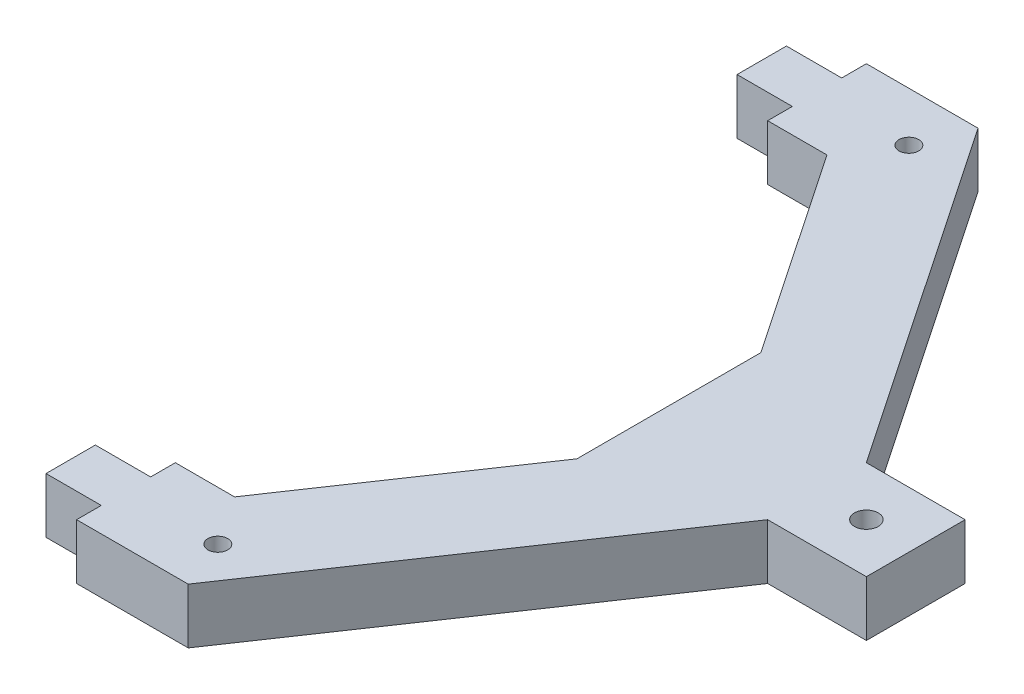
ISO-10303-21;
HEADER;
FILE_DESCRIPTION(('STEP AP214'),'2;1');
FILE_NAME('part.step','',(''),(''),'','','');
FILE_SCHEMA(('AUTOMOTIVE_DESIGN { 1 0 10303 214 1 1 1 1 }'));
ENDSEC;
DATA;
#1=APPLICATION_CONTEXT('core data for automotive mechanical design processes');
#2=APPLICATION_PROTOCOL_DEFINITION('international standard','automotive_design',2000,#1);
#3=PRODUCT_CONTEXT('',#1,'mechanical');
#4=PRODUCT('Part','Part','',(#3));
#5=PRODUCT_RELATED_PRODUCT_CATEGORY('part','',(#4));
#6=PRODUCT_DEFINITION_FORMATION('','',#4);
#7=PRODUCT_DEFINITION_CONTEXT('part definition',#1,'design');
#8=PRODUCT_DEFINITION('design','',#6,#7);
#9=PRODUCT_DEFINITION_SHAPE('','',#8);
#10=(LENGTH_UNIT() NAMED_UNIT(*) SI_UNIT(.MILLI.,.METRE.));
#11=(NAMED_UNIT(*) PLANE_ANGLE_UNIT() SI_UNIT($,.RADIAN.));
#12=(NAMED_UNIT(*) SI_UNIT($,.STERADIAN.) SOLID_ANGLE_UNIT());
#13=UNCERTAINTY_MEASURE_WITH_UNIT(LENGTH_MEASURE(1.E-05),#10,'distance_accuracy_value','');
#14=(GEOMETRIC_REPRESENTATION_CONTEXT(3) GLOBAL_UNCERTAINTY_ASSIGNED_CONTEXT((#13)) GLOBAL_UNIT_ASSIGNED_CONTEXT((#10,
#11,#12)) REPRESENTATION_CONTEXT('',''));
#15=CARTESIAN_POINT('',(0.,0.,0.));
#16=DIRECTION('',(0.,0.,1.));
#17=DIRECTION('',(1.,0.,0.));
#18=AXIS2_PLACEMENT_3D('',#15,#16,#17);
#19=CARTESIAN_POINT('',(-87.5,14.,0.));
#20=DIRECTION('',(1.,0.,0.));
#21=DIRECTION('',(0.,0.,-1.));
#22=AXIS2_PLACEMENT_3D('',#19,#20,#21);
#23=PLANE('',#22);
#24=DIRECTION('',(0.,1.,0.));
#25=VECTOR('',#24,1.);
#26=CARTESIAN_POINT('',(-87.5,-18.7683243791235,-93.75));
#27=LINE('',#26,#25);
#28=CARTESIAN_POINT('',(-87.5,0.,-93.75));
#29=VERTEX_POINT('',#28);
#30=CARTESIAN_POINT('',(-87.5,14.,-93.75));
#31=VERTEX_POINT('',#30);
#32=EDGE_CURVE('E72',#29,#31,#27,.T.);
#33=ORIENTED_EDGE('',*,*,#32,.F.);
#34=DIRECTION('',(0.,0.,1.));
#35=VECTOR('',#34,1.);
#36=CARTESIAN_POINT('',(-87.5,0.,0.));
#37=LINE('',#36,#35);
#38=CARTESIAN_POINT('',(-87.5,0.,-87.5));
#39=VERTEX_POINT('',#38);
#40=EDGE_CURVE('E353',#29,#39,#37,.T.);
#41=ORIENTED_EDGE('',*,*,#40,.T.);
#42=DIRECTION('',(0.,-1.,0.));
#43=VECTOR('',#42,1.);
#44=CARTESIAN_POINT('',(-87.5,14.,-87.5));
#45=LINE('',#44,#43);
#46=CARTESIAN_POINT('',(-87.5,14.,-87.5));
#47=VERTEX_POINT('',#46);
#48=EDGE_CURVE('E364',#47,#39,#45,.T.);
#49=ORIENTED_EDGE('',*,*,#48,.F.);
#50=DIRECTION('',(0.,0.,1.));
#51=VECTOR('',#50,1.);
#52=CARTESIAN_POINT('',(-87.5,14.,0.));
#53=LINE('',#52,#51);
#54=EDGE_CURVE('E331',#31,#47,#53,.T.);
#55=ORIENTED_EDGE('',*,*,#54,.F.);
#56=EDGE_LOOP('',(#33,#41,#49,#55));
#57=FACE_BOUND('',#56,.T.);
#58=ADVANCED_FACE('F49',(#57),#23,.F.);
#59=CARTESIAN_POINT('',(-37.5,14.,0.));
#60=DIRECTION('',(1.,0.,0.));
#61=DIRECTION('',(0.,0.,-1.));
#62=AXIS2_PLACEMENT_3D('',#59,#60,#61);
#63=PLANE('',#62);
#64=DIRECTION('',(0.,0.,1.));
#65=VECTOR('',#64,1.);
#66=CARTESIAN_POINT('',(-37.5,0.,0.));
#67=LINE('',#66,#65);
#68=CARTESIAN_POINT('',(-37.5,0.,-35.7985114321141));
#69=VERTEX_POINT('',#68);
#70=CARTESIAN_POINT('',(-37.5,0.,10.7985114321141));
#71=VERTEX_POINT('',#70);
#72=EDGE_CURVE('E315',#69,#71,#67,.T.);
#73=ORIENTED_EDGE('',*,*,#72,.T.);
#74=DIRECTION('',(0.,-1.,0.));
#75=VECTOR('',#74,1.);
#76=CARTESIAN_POINT('',(-37.5,14.,10.7985114321141));
#77=LINE('',#76,#75);
#78=CARTESIAN_POINT('',(-37.5,14.,10.7985114321141));
#79=VERTEX_POINT('',#78);
#80=EDGE_CURVE('E255',#79,#71,#77,.T.);
#81=ORIENTED_EDGE('',*,*,#80,.F.);
#82=DIRECTION('',(0.,0.,1.));
#83=VECTOR('',#82,1.);
#84=CARTESIAN_POINT('',(-37.5,14.,0.));
#85=LINE('',#84,#83);
#86=CARTESIAN_POINT('',(-37.5,14.,-35.7985114321141));
#87=VERTEX_POINT('',#86);
#88=EDGE_CURVE('E316',#87,#79,#85,.T.);
#89=ORIENTED_EDGE('',*,*,#88,.F.);
#90=DIRECTION('',(0.,-1.,0.));
#91=VECTOR('',#90,1.);
#92=CARTESIAN_POINT('',(-37.5,14.,-35.7985114321141));
#93=LINE('',#92,#91);
#94=EDGE_CURVE('E338',#87,#69,#93,.T.);
#95=ORIENTED_EDGE('',*,*,#94,.T.);
#96=EDGE_LOOP('',(#73,#81,#89,#95));
#97=FACE_BOUND('',#96,.T.);
#98=ADVANCED_FACE('F51',(#97),#63,.F.);
#99=CARTESIAN_POINT('',(12.5,14.,-12.5));
#100=DIRECTION('',(0.,-1.,0.));
#101=DIRECTION('',(0.,0.,-1.));
#102=AXIS2_PLACEMENT_3D('',#99,#100,#101);
#103=CYLINDRICAL_SURFACE('',#102,3.);
#104=CARTESIAN_POINT('',(12.5,0.,-12.5));
#105=DIRECTION('',(0.,1.,0.));
#106=DIRECTION('',(0.,0.,1.));
#107=AXIS2_PLACEMENT_3D('',#104,#105,#106);
#108=CIRCLE('',#107,3.);
#109=CARTESIAN_POINT('',(12.5,0.,-9.5));
#110=VERTEX_POINT('',#109);
#111=EDGE_CURVE('E340',#110,#110,#108,.F.);
#112=ORIENTED_EDGE('',*,*,#111,.T.);
#113=EDGE_LOOP('',(#112));
#114=FACE_BOUND('',#113,.T.);
#115=CARTESIAN_POINT('',(12.5,14.,-12.5));
#116=DIRECTION('',(0.,1.,0.));
#117=DIRECTION('',(0.,0.,1.));
#118=AXIS2_PLACEMENT_3D('',#115,#116,#117);
#119=CIRCLE('',#118,3.);
#120=CARTESIAN_POINT('',(12.5,14.,-9.5));
#121=VERTEX_POINT('',#120);
#122=EDGE_CURVE('E318',#121,#121,#119,.F.);
#123=ORIENTED_EDGE('',*,*,#122,.F.);
#124=EDGE_LOOP('',(#123));
#125=FACE_BOUND('',#124,.T.);
#126=ADVANCED_FACE('F431',(#114,#125),#103,.F.);
#127=CARTESIAN_POINT('',(25.,14.,0.));
#128=DIRECTION('',(-1.,0.,0.));
#129=DIRECTION('',(0.,0.,1.));
#130=AXIS2_PLACEMENT_3D('',#127,#128,#129);
#131=PLANE('',#130);
#132=DIRECTION('',(0.,0.,-1.));
#133=VECTOR('',#132,1.);
#134=CARTESIAN_POINT('',(25.,0.,0.));
#135=LINE('',#134,#133);
#136=CARTESIAN_POINT('',(25.,0.,0.));
#137=VERTEX_POINT('',#136);
#138=CARTESIAN_POINT('',(25.,0.,-25.));
#139=VERTEX_POINT('',#138);
#140=EDGE_CURVE('E343',#137,#139,#135,.T.);
#141=ORIENTED_EDGE('',*,*,#140,.T.);
#142=DIRECTION('',(0.,-1.,0.));
#143=VECTOR('',#142,1.);
#144=CARTESIAN_POINT('',(25.,14.,-25.));
#145=LINE('',#144,#143);
#146=CARTESIAN_POINT('',(25.,14.,-25.));
#147=VERTEX_POINT('',#146);
#148=EDGE_CURVE('E11',#147,#139,#145,.T.);
#149=ORIENTED_EDGE('',*,*,#148,.F.);
#150=DIRECTION('',(0.,0.,-1.));
#151=VECTOR('',#150,1.);
#152=CARTESIAN_POINT('',(25.,14.,0.));
#153=LINE('',#152,#151);
#154=CARTESIAN_POINT('',(25.,14.,0.));
#155=VERTEX_POINT('',#154);
#156=EDGE_CURVE('E322',#155,#147,#153,.T.);
#157=ORIENTED_EDGE('',*,*,#156,.F.);
#158=DIRECTION('',(0.,-1.,0.));
#159=VECTOR('',#158,1.);
#160=CARTESIAN_POINT('',(25.,14.,0.));
#161=LINE('',#160,#159);
#162=EDGE_CURVE('E290',#155,#137,#161,.T.);
#163=ORIENTED_EDGE('',*,*,#162,.T.);
#164=EDGE_LOOP('',(#141,#149,#157,#163));
#165=FACE_BOUND('',#164,.T.);
#166=ADVANCED_FACE('F388',(#165),#131,.F.);
#167=CARTESIAN_POINT('',(0.,14.,-25.));
#168=DIRECTION('',(0.,0.,-1.));
#169=DIRECTION('',(-1.,0.,0.));
#170=AXIS2_PLACEMENT_3D('',#167,#168,#169);
#171=PLANE('',#170);
#172=DIRECTION('',(1.,0.,0.));
#173=VECTOR('',#172,1.);
#174=CARTESIAN_POINT('',(0.,0.,-25.));
#175=LINE('',#174,#173);
#176=CARTESIAN_POINT('',(0.,0.,-25.));
#177=VERTEX_POINT('',#176);
#178=EDGE_CURVE('E346',#177,#139,#175,.T.);
#179=ORIENTED_EDGE('',*,*,#178,.F.);
#180=DIRECTION('',(0.,-1.,0.));
#181=VECTOR('',#180,1.);
#182=CARTESIAN_POINT('',(0.,14.,-25.));
#183=LINE('',#182,#181);
#184=CARTESIAN_POINT('',(0.,14.,-25.));
#185=VERTEX_POINT('',#184);
#186=EDGE_CURVE('E57',#185,#177,#183,.T.);
#187=ORIENTED_EDGE('',*,*,#186,.F.);
#188=DIRECTION('',(1.,0.,0.));
#189=VECTOR('',#188,1.);
#190=CARTESIAN_POINT('',(0.,14.,-25.));
#191=LINE('',#190,#189);
#192=EDGE_CURVE('E324',#185,#147,#191,.T.);
#193=ORIENTED_EDGE('',*,*,#192,.T.);
#194=ORIENTED_EDGE('',*,*,#148,.T.);
#195=EDGE_LOOP('',(#179,#187,#193,#194));
#196=FACE_BOUND('',#195,.T.);
#197=ADVANCED_FACE('F385',(#196),#171,.T.);
#198=CARTESIAN_POINT('',(11.6055137971177,14.,-7.85650460268225));
#199=DIRECTION('',(-0.828094086377091,0.,0.560589140197427));
#200=DIRECTION('',(0.560589140197427,0.,0.828094086377091));
#201=AXIS2_PLACEMENT_3D('',#198,#199,#200);
#202=PLANE('',#201);
#203=DIRECTION('',(-0.560589140197427,0.,-0.828094086377091));
#204=VECTOR('',#203,1.);
#205=CARTESIAN_POINT('',(11.6055137971177,0.,-7.85650460268225));
#206=LINE('',#205,#204);
#207=CARTESIAN_POINT('',(-59.2342712914123,0.,-112.5));
#208=VERTEX_POINT('',#207);
#209=EDGE_CURVE('E349',#177,#208,#206,.T.);
#210=ORIENTED_EDGE('',*,*,#209,.T.);
#211=DIRECTION('',(0.,-1.,0.));
#212=VECTOR('',#211,1.);
#213=CARTESIAN_POINT('',(-59.2342712914123,14.,-112.5));
#214=LINE('',#213,#212);
#215=CARTESIAN_POINT('',(-59.2342712914123,14.,-112.5));
#216=VERTEX_POINT('',#215);
#217=EDGE_CURVE('E370',#216,#208,#214,.T.);
#218=ORIENTED_EDGE('',*,*,#217,.F.);
#219=DIRECTION('',(-0.560589140197427,0.,-0.828094086377091));
#220=VECTOR('',#219,1.);
#221=CARTESIAN_POINT('',(11.6055137971177,14.,-7.85650460268225));
#222=LINE('',#221,#220);
#223=EDGE_CURVE('E327',#185,#216,#222,.T.);
#224=ORIENTED_EDGE('',*,*,#223,.F.);
#225=ORIENTED_EDGE('',*,*,#186,.T.);
#226=EDGE_LOOP('',(#210,#218,#224,#225));
#227=FACE_BOUND('',#226,.T.);
#228=ADVANCED_FACE('F375',(#227),#202,.F.);
#229=CARTESIAN_POINT('',(0.,14.,-112.5));
#230=DIRECTION('',(0.,0.,1.));
#231=DIRECTION('',(1.,0.,0.));
#232=AXIS2_PLACEMENT_3D('',#229,#230,#231);
#233=PLANE('',#232);
#234=DIRECTION('',(-1.,0.,0.));
#235=VECTOR('',#234,1.);
#236=CARTESIAN_POINT('',(0.,0.,-112.5));
#237=LINE('',#236,#235);
#238=CARTESIAN_POINT('',(-87.5,0.,-112.5));
#239=VERTEX_POINT('',#238);
#240=EDGE_CURVE('E351',#208,#239,#237,.T.);
#241=ORIENTED_EDGE('',*,*,#240,.T.);
#242=DIRECTION('',(0.,-1.,0.));
#243=VECTOR('',#242,1.);
#244=CARTESIAN_POINT('',(-87.5,14.,-112.5));
#245=LINE('',#244,#243);
#246=CARTESIAN_POINT('',(-87.5,14.,-112.5));
#247=VERTEX_POINT('',#246);
#248=EDGE_CURVE('E367',#247,#239,#245,.T.);
#249=ORIENTED_EDGE('',*,*,#248,.F.);
#250=DIRECTION('',(-1.,0.,0.));
#251=VECTOR('',#250,1.);
#252=CARTESIAN_POINT('',(0.,14.,-112.5));
#253=LINE('',#252,#251);
#254=EDGE_CURVE('E329',#216,#247,#253,.T.);
#255=ORIENTED_EDGE('',*,*,#254,.F.);
#256=ORIENTED_EDGE('',*,*,#217,.T.);
#257=EDGE_LOOP('',(#241,#249,#255,#256));
#258=FACE_BOUND('',#257,.T.);
#259=ADVANCED_FACE('F452',(#258),#233,.F.);
#260=CARTESIAN_POINT('',(-87.5,0.,-106.25));
#261=VERTEX_POINT('',#260);
#262=EDGE_CURVE('E354',#239,#261,#37,.T.);
#263=ORIENTED_EDGE('',*,*,#262,.T.);
#264=DIRECTION('',(0.,1.,0.));
#265=VECTOR('',#264,1.);
#266=CARTESIAN_POINT('',(-87.5,-18.7683243791235,-106.25));
#267=LINE('',#266,#265);
#268=CARTESIAN_POINT('',(-87.5,14.,-106.25));
#269=VERTEX_POINT('',#268);
#270=EDGE_CURVE('E64',#261,#269,#267,.T.);
#271=ORIENTED_EDGE('',*,*,#270,.T.);
#272=EDGE_CURVE('E332',#247,#269,#53,.T.);
#273=ORIENTED_EDGE('',*,*,#272,.F.);
#274=ORIENTED_EDGE('',*,*,#248,.T.);
#275=EDGE_LOOP('',(#263,#271,#273,#274));
#276=FACE_BOUND('',#275,.T.);
#277=ADVANCED_FACE('F442',(#276),#23,.F.);
#278=CARTESIAN_POINT('',(0.,14.,-87.5));
#279=DIRECTION('',(0.,0.,-1.));
#280=DIRECTION('',(-1.,0.,0.));
#281=AXIS2_PLACEMENT_3D('',#278,#279,#280);
#282=PLANE('',#281);
#283=DIRECTION('',(1.,0.,0.));
#284=VECTOR('',#283,1.);
#285=CARTESIAN_POINT('',(0.,0.,-87.5));
#286=LINE('',#285,#284);
#287=CARTESIAN_POINT('',(-72.5,0.,-87.5));
#288=VERTEX_POINT('',#287);
#289=EDGE_CURVE('E356',#39,#288,#286,.T.);
#290=ORIENTED_EDGE('',*,*,#289,.T.);
#291=DIRECTION('',(0.,-1.,0.));
#292=VECTOR('',#291,1.);
#293=CARTESIAN_POINT('',(-72.5,14.,-87.5));
#294=LINE('',#293,#292);
#295=CARTESIAN_POINT('',(-72.5,14.,-87.5));
#296=VERTEX_POINT('',#295);
#297=EDGE_CURVE('E361',#296,#288,#294,.T.);
#298=ORIENTED_EDGE('',*,*,#297,.F.);
#299=DIRECTION('',(1.,0.,0.));
#300=VECTOR('',#299,1.);
#301=CARTESIAN_POINT('',(0.,14.,-87.5));
#302=LINE('',#301,#300);
#303=EDGE_CURVE('E334',#47,#296,#302,.T.);
#304=ORIENTED_EDGE('',*,*,#303,.F.);
#305=ORIENTED_EDGE('',*,*,#48,.T.);
#306=EDGE_LOOP('',(#290,#298,#304,#305));
#307=FACE_BOUND('',#306,.T.);
#308=ADVANCED_FACE('F451',(#307),#282,.F.);
#309=CARTESIAN_POINT('',(-9.09683836230961,14.,6.15822390225342));
#310=DIRECTION('',(0.828094086377092,0.,-0.560589140197427));
#311=DIRECTION('',(-0.560589140197427,0.,-0.828094086377092));
#312=AXIS2_PLACEMENT_3D('',#309,#310,#311);
#313=PLANE('',#312);
#314=DIRECTION('',(0.560589140197427,0.,0.828094086377092));
#315=VECTOR('',#314,1.);
#316=CARTESIAN_POINT('',(-9.09683836230961,0.,6.15822390225342));
#317=LINE('',#316,#315);
#318=EDGE_CURVE('E319',#288,#69,#317,.T.);
#319=ORIENTED_EDGE('',*,*,#318,.T.);
#320=ORIENTED_EDGE('',*,*,#94,.F.);
#321=DIRECTION('',(0.560589140197427,0.,0.828094086377092));
#322=VECTOR('',#321,1.);
#323=CARTESIAN_POINT('',(-9.09683836230961,14.,6.15822390225342));
#324=LINE('',#323,#322);
#325=EDGE_CURVE('E336',#296,#87,#324,.T.);
#326=ORIENTED_EDGE('',*,*,#325,.F.);
#327=ORIENTED_EDGE('',*,*,#297,.T.);
#328=EDGE_LOOP('',(#319,#320,#326,#327));
#329=FACE_BOUND('',#328,.T.);
#330=ADVANCED_FACE('F425',(#329),#313,.F.);
#331=CARTESIAN_POINT('',(0.,14.,0.));
#332=DIRECTION('',(0.,1.,0.));
#333=DIRECTION('',(0.,0.,1.));
#334=AXIS2_PLACEMENT_3D('',#331,#332,#333);
#335=PLANE('',#334);
#336=CARTESIAN_POINT('',(-64.2342712914123,14.,-100.));
#337=DIRECTION('',(0.,1.,0.));
#338=DIRECTION('',(0.,0.,1.));
#339=AXIS2_PLACEMENT_3D('',#336,#337,#338);
#340=CIRCLE('',#339,2.50000000000002);
#341=CARTESIAN_POINT('',(-64.2342712914123,14.,-97.4999999999999));
#342=VERTEX_POINT('',#341);
#343=EDGE_CURVE('E417',#342,#342,#340,.T.);
#344=ORIENTED_EDGE('',*,*,#343,.F.);
#345=EDGE_LOOP('',(#344));
#346=FACE_BOUND('',#345,.T.);
#347=CARTESIAN_POINT('',(-64.2342712914123,14.,75.));
#348=DIRECTION('',(0.,1.,0.));
#349=DIRECTION('',(0.,0.,1.));
#350=AXIS2_PLACEMENT_3D('',#347,#348,#349);
#351=CIRCLE('',#350,2.50000000000002);
#352=CARTESIAN_POINT('',(-64.2342712914123,14.,77.5));
#353=VERTEX_POINT('',#352);
#354=EDGE_CURVE('E411',#353,#353,#351,.T.);
#355=ORIENTED_EDGE('',*,*,#354,.F.);
#356=EDGE_LOOP('',(#355));
#357=FACE_BOUND('',#356,.T.);
#358=ORIENTED_EDGE('',*,*,#122,.T.);
#359=EDGE_LOOP('',(#358));
#360=FACE_BOUND('',#359,.T.);
#361=ORIENTED_EDGE('',*,*,#88,.T.);
#362=DIRECTION('',(0.560589140197427,0.,-0.828094086377092));
#363=VECTOR('',#362,1.);
#364=CARTESIAN_POINT('',(-9.09683836230961,14.,-31.1582239022534));
#365=LINE('',#364,#363);
#366=CARTESIAN_POINT('',(-72.5,14.,62.5));
#367=VERTEX_POINT('',#366);
#368=EDGE_CURVE('E252',#367,#79,#365,.T.);
#369=ORIENTED_EDGE('',*,*,#368,.F.);
#370=DIRECTION('',(1.,0.,0.));
#371=VECTOR('',#370,1.);
#372=CARTESIAN_POINT('',(0.,14.,62.5));
#373=LINE('',#372,#371);
#374=CARTESIAN_POINT('',(-87.5,14.,62.5));
#375=VERTEX_POINT('',#374);
#376=EDGE_CURVE('E249',#375,#367,#373,.T.);
#377=ORIENTED_EDGE('',*,*,#376,.F.);
#378=DIRECTION('',(0.,0.,-1.));
#379=VECTOR('',#378,1.);
#380=CARTESIAN_POINT('',(-87.5,14.,-25.));
#381=LINE('',#380,#379);
#382=CARTESIAN_POINT('',(-87.5,14.,68.75));
#383=VERTEX_POINT('',#382);
#384=EDGE_CURVE('E221',#383,#375,#381,.T.);
#385=ORIENTED_EDGE('',*,*,#384,.F.);
#386=DIRECTION('',(1.,0.,0.));
#387=VECTOR('',#386,1.);
#388=CARTESIAN_POINT('',(-101.5,14.,68.75));
#389=LINE('',#388,#387);
#390=CARTESIAN_POINT('',(-101.5,14.,68.75));
#391=VERTEX_POINT('',#390);
#392=EDGE_CURVE('E202',#391,#383,#389,.T.);
#393=ORIENTED_EDGE('',*,*,#392,.F.);
#394=DIRECTION('',(0.,0.,-1.));
#395=VECTOR('',#394,1.);
#396=CARTESIAN_POINT('',(-101.5,14.,81.25));
#397=LINE('',#396,#395);
#398=CARTESIAN_POINT('',(-101.5,14.,81.25));
#399=VERTEX_POINT('',#398);
#400=EDGE_CURVE('E212',#399,#391,#397,.T.);
#401=ORIENTED_EDGE('',*,*,#400,.F.);
#402=DIRECTION('',(-1.,0.,0.));
#403=VECTOR('',#402,1.);
#404=CARTESIAN_POINT('',(-101.5,14.,81.25));
#405=LINE('',#404,#403);
#406=CARTESIAN_POINT('',(-87.5,14.,81.25));
#407=VERTEX_POINT('',#406);
#408=EDGE_CURVE('E209',#407,#399,#405,.T.);
#409=ORIENTED_EDGE('',*,*,#408,.F.);
#410=CARTESIAN_POINT('',(-87.5,14.,87.5));
#411=VERTEX_POINT('',#410);
#412=EDGE_CURVE('E246',#411,#407,#381,.T.);
#413=ORIENTED_EDGE('',*,*,#412,.F.);
#414=DIRECTION('',(-1.,0.,0.));
#415=VECTOR('',#414,1.);
#416=CARTESIAN_POINT('',(0.,14.,87.5));
#417=LINE('',#416,#415);
#418=CARTESIAN_POINT('',(-59.2342712914123,14.,87.5));
#419=VERTEX_POINT('',#418);
#420=EDGE_CURVE('E243',#419,#411,#417,.T.);
#421=ORIENTED_EDGE('',*,*,#420,.F.);
#422=DIRECTION('',(-0.560589140197427,0.,0.828094086377091));
#423=VECTOR('',#422,1.);
#424=CARTESIAN_POINT('',(11.6055137971177,14.,-17.1434953973177));
#425=LINE('',#424,#423);
#426=CARTESIAN_POINT('',(0.,14.,0.));
#427=VERTEX_POINT('',#426);
#428=EDGE_CURVE('E239',#427,#419,#425,.T.);
#429=ORIENTED_EDGE('',*,*,#428,.F.);
#430=DIRECTION('',(1.,0.,0.));
#431=VECTOR('',#430,1.);
#432=CARTESIAN_POINT('',(0.,14.,0.));
#433=LINE('',#432,#431);
#434=EDGE_CURVE('E236',#427,#155,#433,.T.);
#435=ORIENTED_EDGE('',*,*,#434,.T.);
#436=ORIENTED_EDGE('',*,*,#156,.T.);
#437=ORIENTED_EDGE('',*,*,#192,.F.);
#438=ORIENTED_EDGE('',*,*,#223,.T.);
#439=ORIENTED_EDGE('',*,*,#254,.T.);
#440=ORIENTED_EDGE('',*,*,#272,.T.);
#441=DIRECTION('',(-1.,0.,0.));
#442=VECTOR('',#441,1.);
#443=CARTESIAN_POINT('',(-101.5,14.,-106.25));
#444=LINE('',#443,#442);
#445=CARTESIAN_POINT('',(-101.5,14.,-106.25));
#446=VERTEX_POINT('',#445);
#447=EDGE_CURVE('E306',#269,#446,#444,.T.);
#448=ORIENTED_EDGE('',*,*,#447,.T.);
#449=DIRECTION('',(0.,0.,1.));
#450=VECTOR('',#449,1.);
#451=CARTESIAN_POINT('',(-101.5,14.,-106.25));
#452=LINE('',#451,#450);
#453=CARTESIAN_POINT('',(-101.5,14.,-93.75));
#454=VERTEX_POINT('',#453);
#455=EDGE_CURVE('E293',#446,#454,#452,.T.);
#456=ORIENTED_EDGE('',*,*,#455,.T.);
#457=DIRECTION('',(1.,0.,0.));
#458=VECTOR('',#457,1.);
#459=CARTESIAN_POINT('',(-101.5,14.,-93.75));
#460=LINE('',#459,#458);
#461=EDGE_CURVE('E303',#454,#31,#460,.T.);
#462=ORIENTED_EDGE('',*,*,#461,.T.);
#463=ORIENTED_EDGE('',*,*,#54,.T.);
#464=ORIENTED_EDGE('',*,*,#303,.T.);
#465=ORIENTED_EDGE('',*,*,#325,.T.);
#466=EDGE_LOOP('',(#361,#369,#377,#385,#393,#401,#409,#413,#421,#429,#435,#436,#437,#438,#439,
#440,#448,#456,#462,#463,#464,#465));
#467=FACE_BOUND('',#466,.T.);
#468=ADVANCED_FACE('F219',(#346,#357,#360,#467),#335,.T.);
#469=CARTESIAN_POINT('',(0.,0.,0.));
#470=DIRECTION('',(0.,1.,0.));
#471=DIRECTION('',(0.,0.,1.));
#472=AXIS2_PLACEMENT_3D('',#469,#470,#471);
#473=PLANE('',#472);
#474=CARTESIAN_POINT('',(-64.2342712914123,0.,-100.));
#475=DIRECTION('',(0.,1.,0.));
#476=DIRECTION('',(0.,0.,1.));
#477=AXIS2_PLACEMENT_3D('',#474,#475,#476);
#478=CIRCLE('',#477,2.50000000000001);
#479=CARTESIAN_POINT('',(-64.2342712914123,0.,-97.4999999999999));
#480=VERTEX_POINT('',#479);
#481=EDGE_CURVE('E414',#480,#480,#478,.T.);
#482=ORIENTED_EDGE('',*,*,#481,.T.);
#483=EDGE_LOOP('',(#482));
#484=FACE_BOUND('',#483,.T.);
#485=CARTESIAN_POINT('',(-64.2342712914123,0.,75.));
#486=DIRECTION('',(0.,1.,0.));
#487=DIRECTION('',(0.,0.,1.));
#488=AXIS2_PLACEMENT_3D('',#485,#486,#487);
#489=CIRCLE('',#488,2.50000000000001);
#490=CARTESIAN_POINT('',(-64.2342712914123,0.,77.5));
#491=VERTEX_POINT('',#490);
#492=EDGE_CURVE('E217',#491,#491,#489,.T.);
#493=ORIENTED_EDGE('',*,*,#492,.T.);
#494=EDGE_LOOP('',(#493));
#495=FACE_BOUND('',#494,.T.);
#496=ORIENTED_EDGE('',*,*,#111,.F.);
#497=EDGE_LOOP('',(#496));
#498=FACE_BOUND('',#497,.T.);
#499=ORIENTED_EDGE('',*,*,#72,.F.);
#500=ORIENTED_EDGE('',*,*,#318,.F.);
#501=ORIENTED_EDGE('',*,*,#289,.F.);
#502=ORIENTED_EDGE('',*,*,#40,.F.);
#503=DIRECTION('',(-1.,0.,0.));
#504=VECTOR('',#503,1.);
#505=CARTESIAN_POINT('',(-101.5,0.,-93.75));
#506=LINE('',#505,#504);
#507=CARTESIAN_POINT('',(-101.5,0.,-93.75));
#508=VERTEX_POINT('',#507);
#509=EDGE_CURVE('E300',#29,#508,#506,.T.);
#510=ORIENTED_EDGE('',*,*,#509,.T.);
#511=DIRECTION('',(0.,0.,-1.));
#512=VECTOR('',#511,1.);
#513=CARTESIAN_POINT('',(-101.5,0.,-106.25));
#514=LINE('',#513,#512);
#515=CARTESIAN_POINT('',(-101.5,0.,-106.25));
#516=VERTEX_POINT('',#515);
#517=EDGE_CURVE('E297',#508,#516,#514,.T.);
#518=ORIENTED_EDGE('',*,*,#517,.T.);
#519=DIRECTION('',(1.,0.,0.));
#520=VECTOR('',#519,1.);
#521=CARTESIAN_POINT('',(-101.5,0.,-106.25));
#522=LINE('',#521,#520);
#523=EDGE_CURVE('E294',#516,#261,#522,.T.);
#524=ORIENTED_EDGE('',*,*,#523,.T.);
#525=ORIENTED_EDGE('',*,*,#262,.F.);
#526=ORIENTED_EDGE('',*,*,#240,.F.);
#527=ORIENTED_EDGE('',*,*,#209,.F.);
#528=ORIENTED_EDGE('',*,*,#178,.T.);
#529=ORIENTED_EDGE('',*,*,#140,.F.);
#530=DIRECTION('',(1.,0.,0.));
#531=VECTOR('',#530,1.);
#532=CARTESIAN_POINT('',(0.,0.,0.));
#533=LINE('',#532,#531);
#534=CARTESIAN_POINT('',(0.,0.,0.));
#535=VERTEX_POINT('',#534);
#536=EDGE_CURVE('E234',#535,#137,#533,.T.);
#537=ORIENTED_EDGE('',*,*,#536,.F.);
#538=DIRECTION('',(-0.560589140197427,0.,0.828094086377091));
#539=VECTOR('',#538,1.);
#540=CARTESIAN_POINT('',(11.6055137971177,0.,-17.1434953973177));
#541=LINE('',#540,#539);
#542=CARTESIAN_POINT('',(-59.2342712914123,0.,87.5));
#543=VERTEX_POINT('',#542);
#544=EDGE_CURVE('E258',#535,#543,#541,.T.);
#545=ORIENTED_EDGE('',*,*,#544,.T.);
#546=DIRECTION('',(-1.,0.,0.));
#547=VECTOR('',#546,1.);
#548=CARTESIAN_POINT('',(0.,0.,87.5));
#549=LINE('',#548,#547);
#550=CARTESIAN_POINT('',(-87.5,0.,87.5));
#551=VERTEX_POINT('',#550);
#552=EDGE_CURVE('E261',#543,#551,#549,.T.);
#553=ORIENTED_EDGE('',*,*,#552,.T.);
#554=DIRECTION('',(0.,0.,-1.));
#555=VECTOR('',#554,1.);
#556=CARTESIAN_POINT('',(-87.5,0.,-25.));
#557=LINE('',#556,#555);
#558=CARTESIAN_POINT('',(-87.5,0.,81.25));
#559=VERTEX_POINT('',#558);
#560=EDGE_CURVE('E265',#551,#559,#557,.T.);
#561=ORIENTED_EDGE('',*,*,#560,.T.);
#562=DIRECTION('',(1.,0.,0.));
#563=VECTOR('',#562,1.);
#564=CARTESIAN_POINT('',(-101.5,0.,81.25));
#565=LINE('',#564,#563);
#566=CARTESIAN_POINT('',(-101.5,0.,81.25));
#567=VERTEX_POINT('',#566);
#568=EDGE_CURVE('E228',#567,#559,#565,.T.);
#569=ORIENTED_EDGE('',*,*,#568,.F.);
#570=DIRECTION('',(0.,0.,1.));
#571=VECTOR('',#570,1.);
#572=CARTESIAN_POINT('',(-101.5,0.,81.25));
#573=LINE('',#572,#571);
#574=CARTESIAN_POINT('',(-101.5,0.,68.75));
#575=VERTEX_POINT('',#574);
#576=EDGE_CURVE('E235',#575,#567,#573,.T.);
#577=ORIENTED_EDGE('',*,*,#576,.F.);
#578=DIRECTION('',(-1.,0.,0.));
#579=VECTOR('',#578,1.);
#580=CARTESIAN_POINT('',(-101.5,0.,68.75));
#581=LINE('',#580,#579);
#582=CARTESIAN_POINT('',(-87.5,0.,68.75));
#583=VERTEX_POINT('',#582);
#584=EDGE_CURVE('E204',#583,#575,#581,.T.);
#585=ORIENTED_EDGE('',*,*,#584,.F.);
#586=CARTESIAN_POINT('',(-87.5,0.,62.5));
#587=VERTEX_POINT('',#586);
#588=EDGE_CURVE('E264',#583,#587,#557,.T.);
#589=ORIENTED_EDGE('',*,*,#588,.T.);
#590=DIRECTION('',(1.,0.,0.));
#591=VECTOR('',#590,1.);
#592=CARTESIAN_POINT('',(0.,0.,62.5));
#593=LINE('',#592,#591);
#594=CARTESIAN_POINT('',(-72.5,0.,62.5));
#595=VERTEX_POINT('',#594);
#596=EDGE_CURVE('E268',#587,#595,#593,.T.);
#597=ORIENTED_EDGE('',*,*,#596,.T.);
#598=DIRECTION('',(0.560589140197427,0.,-0.828094086377092));
#599=VECTOR('',#598,1.);
#600=CARTESIAN_POINT('',(-9.09683836230961,0.,-31.1582239022534));
#601=LINE('',#600,#599);
#602=EDGE_CURVE('E240',#595,#71,#601,.T.);
#603=ORIENTED_EDGE('',*,*,#602,.T.);
#604=EDGE_LOOP('',(#499,#500,#501,#502,#510,#518,#524,#525,#526,#527,#528,#529,#537,#545,#553,
#561,#569,#577,#585,#589,#597,#603));
#605=FACE_BOUND('',#604,.T.);
#606=ADVANCED_FACE('F383',(#484,#495,#498,#605),#473,.F.);
#607=CARTESIAN_POINT('',(-101.5,-18.7683243791235,-106.25));
#608=DIRECTION('',(-1.,0.,0.));
#609=DIRECTION('',(0.,0.,1.));
#610=AXIS2_PLACEMENT_3D('',#607,#608,#609);
#611=PLANE('',#610);
#612=ORIENTED_EDGE('',*,*,#517,.F.);
#613=DIRECTION('',(0.,1.,0.));
#614=VECTOR('',#613,1.);
#615=CARTESIAN_POINT('',(-101.5,-18.7683243791235,-93.75));
#616=LINE('',#615,#614);
#617=EDGE_CURVE('E309',#508,#454,#616,.T.);
#618=ORIENTED_EDGE('',*,*,#617,.T.);
#619=ORIENTED_EDGE('',*,*,#455,.F.);
#620=DIRECTION('',(0.,1.,0.));
#621=VECTOR('',#620,1.);
#622=CARTESIAN_POINT('',(-101.5,-18.7683243791235,-106.25));
#623=LINE('',#622,#621);
#624=EDGE_CURVE('E298',#516,#446,#623,.T.);
#625=ORIENTED_EDGE('',*,*,#624,.F.);
#626=EDGE_LOOP('',(#612,#618,#619,#625));
#627=FACE_BOUND('',#626,.T.);
#628=ADVANCED_FACE('F471',(#627),#611,.T.);
#629=CARTESIAN_POINT('',(-101.5,-18.7683243791235,-106.25));
#630=DIRECTION('',(0.,0.,-1.));
#631=DIRECTION('',(-1.,0.,0.));
#632=AXIS2_PLACEMENT_3D('',#629,#630,#631);
#633=PLANE('',#632);
#634=ORIENTED_EDGE('',*,*,#523,.F.);
#635=ORIENTED_EDGE('',*,*,#624,.T.);
#636=ORIENTED_EDGE('',*,*,#447,.F.);
#637=ORIENTED_EDGE('',*,*,#270,.F.);
#638=EDGE_LOOP('',(#634,#635,#636,#637));
#639=FACE_BOUND('',#638,.T.);
#640=ADVANCED_FACE('F466',(#639),#633,.T.);
#641=CARTESIAN_POINT('',(-101.5,-18.7683243791235,-93.75));
#642=DIRECTION('',(0.,0.,1.));
#643=DIRECTION('',(1.,0.,0.));
#644=AXIS2_PLACEMENT_3D('',#641,#642,#643);
#645=PLANE('',#644);
#646=ORIENTED_EDGE('',*,*,#509,.F.);
#647=ORIENTED_EDGE('',*,*,#32,.T.);
#648=ORIENTED_EDGE('',*,*,#461,.F.);
#649=ORIENTED_EDGE('',*,*,#617,.F.);
#650=EDGE_LOOP('',(#646,#647,#648,#649));
#651=FACE_BOUND('',#650,.T.);
#652=ADVANCED_FACE('F475',(#651),#645,.T.);
#653=CARTESIAN_POINT('',(-87.5,14.,-25.));
#654=DIRECTION('',(1.,0.,0.));
#655=DIRECTION('',(0.,0.,1.));
#656=AXIS2_PLACEMENT_3D('',#653,#654,#655);
#657=PLANE('',#656);
#658=DIRECTION('',(0.,1.,0.));
#659=VECTOR('',#658,1.);
#660=CARTESIAN_POINT('',(-87.5,-18.7683243791235,68.75));
#661=LINE('',#660,#659);
#662=EDGE_CURVE('E208',#583,#383,#661,.T.);
#663=ORIENTED_EDGE('',*,*,#662,.T.);
#664=ORIENTED_EDGE('',*,*,#384,.T.);
#665=DIRECTION('',(0.,-1.,0.));
#666=VECTOR('',#665,1.);
#667=CARTESIAN_POINT('',(-87.5,14.,62.5));
#668=LINE('',#667,#666);
#669=EDGE_CURVE('E278',#375,#587,#668,.T.);
#670=ORIENTED_EDGE('',*,*,#669,.T.);
#671=ORIENTED_EDGE('',*,*,#588,.F.);
#672=EDGE_LOOP('',(#663,#664,#670,#671));
#673=FACE_BOUND('',#672,.T.);
#674=ADVANCED_FACE('F495',(#673),#657,.F.);
#675=CARTESIAN_POINT('',(0.,14.,0.));
#676=DIRECTION('',(0.,0.,1.));
#677=DIRECTION('',(-1.,0.,0.));
#678=AXIS2_PLACEMENT_3D('',#675,#676,#677);
#679=PLANE('',#678);
#680=ORIENTED_EDGE('',*,*,#536,.T.);
#681=ORIENTED_EDGE('',*,*,#162,.F.);
#682=ORIENTED_EDGE('',*,*,#434,.F.);
#683=DIRECTION('',(0.,-1.,0.));
#684=VECTOR('',#683,1.);
#685=CARTESIAN_POINT('',(0.,14.,0.));
#686=LINE('',#685,#684);
#687=EDGE_CURVE('E287',#427,#535,#686,.T.);
#688=ORIENTED_EDGE('',*,*,#687,.T.);
#689=EDGE_LOOP('',(#680,#681,#682,#688));
#690=FACE_BOUND('',#689,.T.);
#691=ADVANCED_FACE('F392',(#690),#679,.T.);
#692=CARTESIAN_POINT('',(11.6055137971177,14.,-17.1434953973177));
#693=DIRECTION('',(-0.828094086377091,0.,-0.560589140197427));
#694=DIRECTION('',(0.560589140197427,0.,-0.828094086377091));
#695=AXIS2_PLACEMENT_3D('',#692,#693,#694);
#696=PLANE('',#695);
#697=ORIENTED_EDGE('',*,*,#544,.F.);
#698=ORIENTED_EDGE('',*,*,#687,.F.);
#699=ORIENTED_EDGE('',*,*,#428,.T.);
#700=DIRECTION('',(0.,-1.,0.));
#701=VECTOR('',#700,1.);
#702=CARTESIAN_POINT('',(-59.2342712914123,14.,87.5));
#703=LINE('',#702,#701);
#704=EDGE_CURVE('E284',#419,#543,#703,.T.);
#705=ORIENTED_EDGE('',*,*,#704,.T.);
#706=EDGE_LOOP('',(#697,#698,#699,#705));
#707=FACE_BOUND('',#706,.T.);
#708=ADVANCED_FACE('F396',(#707),#696,.F.);
#709=CARTESIAN_POINT('',(0.,14.,87.5));
#710=DIRECTION('',(0.,0.,-1.));
#711=DIRECTION('',(1.,0.,0.));
#712=AXIS2_PLACEMENT_3D('',#709,#710,#711);
#713=PLANE('',#712);
#714=ORIENTED_EDGE('',*,*,#552,.F.);
#715=ORIENTED_EDGE('',*,*,#704,.F.);
#716=ORIENTED_EDGE('',*,*,#420,.T.);
#717=DIRECTION('',(0.,-1.,0.));
#718=VECTOR('',#717,1.);
#719=CARTESIAN_POINT('',(-87.5,14.,87.5));
#720=LINE('',#719,#718);
#721=EDGE_CURVE('E281',#411,#551,#720,.T.);
#722=ORIENTED_EDGE('',*,*,#721,.T.);
#723=EDGE_LOOP('',(#714,#715,#716,#722));
#724=FACE_BOUND('',#723,.T.);
#725=ADVANCED_FACE('F400',(#724),#713,.F.);
#726=ORIENTED_EDGE('',*,*,#560,.F.);
#727=ORIENTED_EDGE('',*,*,#721,.F.);
#728=ORIENTED_EDGE('',*,*,#412,.T.);
#729=DIRECTION('',(0.,1.,0.));
#730=VECTOR('',#729,1.);
#731=CARTESIAN_POINT('',(-87.5,-18.7683243791235,81.25));
#732=LINE('',#731,#730);
#733=EDGE_CURVE('E229',#559,#407,#732,.T.);
#734=ORIENTED_EDGE('',*,*,#733,.F.);
#735=EDGE_LOOP('',(#726,#727,#728,#734));
#736=FACE_BOUND('',#735,.T.);
#737=ADVANCED_FACE('F403',(#736),#657,.F.);
#738=CARTESIAN_POINT('',(0.,14.,62.5));
#739=DIRECTION('',(0.,0.,1.));
#740=DIRECTION('',(-1.,0.,0.));
#741=AXIS2_PLACEMENT_3D('',#738,#739,#740);
#742=PLANE('',#741);
#743=ORIENTED_EDGE('',*,*,#596,.F.);
#744=ORIENTED_EDGE('',*,*,#669,.F.);
#745=ORIENTED_EDGE('',*,*,#376,.T.);
#746=DIRECTION('',(0.,-1.,0.));
#747=VECTOR('',#746,1.);
#748=CARTESIAN_POINT('',(-72.5,14.,62.5));
#749=LINE('',#748,#747);
#750=EDGE_CURVE('E275',#367,#595,#749,.T.);
#751=ORIENTED_EDGE('',*,*,#750,.T.);
#752=EDGE_LOOP('',(#743,#744,#745,#751));
#753=FACE_BOUND('',#752,.T.);
#754=ADVANCED_FACE('F491',(#753),#742,.F.);
#755=CARTESIAN_POINT('',(-9.09683836230961,14.,-31.1582239022534));
#756=DIRECTION('',(0.828094086377092,0.,0.560589140197427));
#757=DIRECTION('',(-0.560589140197427,0.,0.828094086377092));
#758=AXIS2_PLACEMENT_3D('',#755,#756,#757);
#759=PLANE('',#758);
#760=ORIENTED_EDGE('',*,*,#602,.F.);
#761=ORIENTED_EDGE('',*,*,#750,.F.);
#762=ORIENTED_EDGE('',*,*,#368,.T.);
#763=ORIENTED_EDGE('',*,*,#80,.T.);
#764=EDGE_LOOP('',(#760,#761,#762,#763));
#765=FACE_BOUND('',#764,.T.);
#766=ADVANCED_FACE('F487',(#765),#759,.F.);
#767=CARTESIAN_POINT('',(-101.5,-18.7683243791235,81.25));
#768=DIRECTION('',(-1.,0.,0.));
#769=DIRECTION('',(0.,0.,-1.));
#770=AXIS2_PLACEMENT_3D('',#767,#768,#769);
#771=PLANE('',#770);
#772=ORIENTED_EDGE('',*,*,#576,.T.);
#773=DIRECTION('',(0.,1.,0.));
#774=VECTOR('',#773,1.);
#775=CARTESIAN_POINT('',(-101.5,-18.7683243791235,81.25));
#776=LINE('',#775,#774);
#777=EDGE_CURVE('E214',#567,#399,#776,.T.);
#778=ORIENTED_EDGE('',*,*,#777,.T.);
#779=ORIENTED_EDGE('',*,*,#400,.T.);
#780=DIRECTION('',(0.,1.,0.));
#781=VECTOR('',#780,1.);
#782=CARTESIAN_POINT('',(-101.5,-18.7683243791235,68.75));
#783=LINE('',#782,#781);
#784=EDGE_CURVE('E197',#575,#391,#783,.T.);
#785=ORIENTED_EDGE('',*,*,#784,.F.);
#786=EDGE_LOOP('',(#772,#778,#779,#785));
#787=FACE_BOUND('',#786,.T.);
#788=ADVANCED_FACE('F213',(#787),#771,.T.);
#789=CARTESIAN_POINT('',(-101.5,-18.7683243791235,81.25));
#790=DIRECTION('',(0.,0.,1.));
#791=DIRECTION('',(-1.,0.,0.));
#792=AXIS2_PLACEMENT_3D('',#789,#790,#791);
#793=PLANE('',#792);
#794=ORIENTED_EDGE('',*,*,#568,.T.);
#795=ORIENTED_EDGE('',*,*,#733,.T.);
#796=ORIENTED_EDGE('',*,*,#408,.T.);
#797=ORIENTED_EDGE('',*,*,#777,.F.);
#798=EDGE_LOOP('',(#794,#795,#796,#797));
#799=FACE_BOUND('',#798,.T.);
#800=ADVANCED_FACE('F406',(#799),#793,.T.);
#801=CARTESIAN_POINT('',(-101.5,-18.7683243791235,68.75));
#802=DIRECTION('',(0.,0.,-1.));
#803=DIRECTION('',(1.,0.,0.));
#804=AXIS2_PLACEMENT_3D('',#801,#802,#803);
#805=PLANE('',#804);
#806=ORIENTED_EDGE('',*,*,#584,.T.);
#807=ORIENTED_EDGE('',*,*,#784,.T.);
#808=ORIENTED_EDGE('',*,*,#392,.T.);
#809=ORIENTED_EDGE('',*,*,#662,.F.);
#810=EDGE_LOOP('',(#806,#807,#808,#809));
#811=FACE_BOUND('',#810,.T.);
#812=ADVANCED_FACE('F199',(#811),#805,.T.);
#813=CARTESIAN_POINT('',(-64.2342712914123,14.,75.));
#814=DIRECTION('',(0.,1.,0.));
#815=DIRECTION('',(0.,0.,1.));
#816=AXIS2_PLACEMENT_3D('',#813,#814,#815);
#817=CYLINDRICAL_SURFACE('',#816,2.50000000000001);
#818=ORIENTED_EDGE('',*,*,#492,.F.);
#819=EDGE_LOOP('',(#818));
#820=FACE_BOUND('',#819,.T.);
#821=ORIENTED_EDGE('',*,*,#354,.T.);
#822=EDGE_LOOP('',(#821));
#823=FACE_BOUND('',#822,.T.);
#824=ADVANCED_FACE('F631',(#820,#823),#817,.F.);
#825=CARTESIAN_POINT('',(-64.2342712914123,14.,-100.));
#826=DIRECTION('',(0.,1.,0.));
#827=DIRECTION('',(0.,0.,1.));
#828=AXIS2_PLACEMENT_3D('',#825,#826,#827);
#829=CYLINDRICAL_SURFACE('',#828,2.50000000000001);
#830=ORIENTED_EDGE('',*,*,#481,.F.);
#831=EDGE_LOOP('',(#830));
#832=FACE_BOUND('',#831,.T.);
#833=ORIENTED_EDGE('',*,*,#343,.T.);
#834=EDGE_LOOP('',(#833));
#835=FACE_BOUND('',#834,.T.);
#836=ADVANCED_FACE('F421',(#832,#835),#829,.F.);
#837=CLOSED_SHELL('',(#58,#98,#126,#166,#197,#228,#259,#277,#308,#330,#468,#606,#628,#640,#652,
#674,#691,#708,#725,#737,#754,#766,#788,#800,#812,#824,#836));
#838=MANIFOLD_SOLID_BREP('B2',#837);
#839=ADVANCED_BREP_SHAPE_REPRESENTATION('',(#18,#838),#14);
#840=SHAPE_DEFINITION_REPRESENTATION(#9,#839);
ENDSEC;
END-ISO-10303-21;
